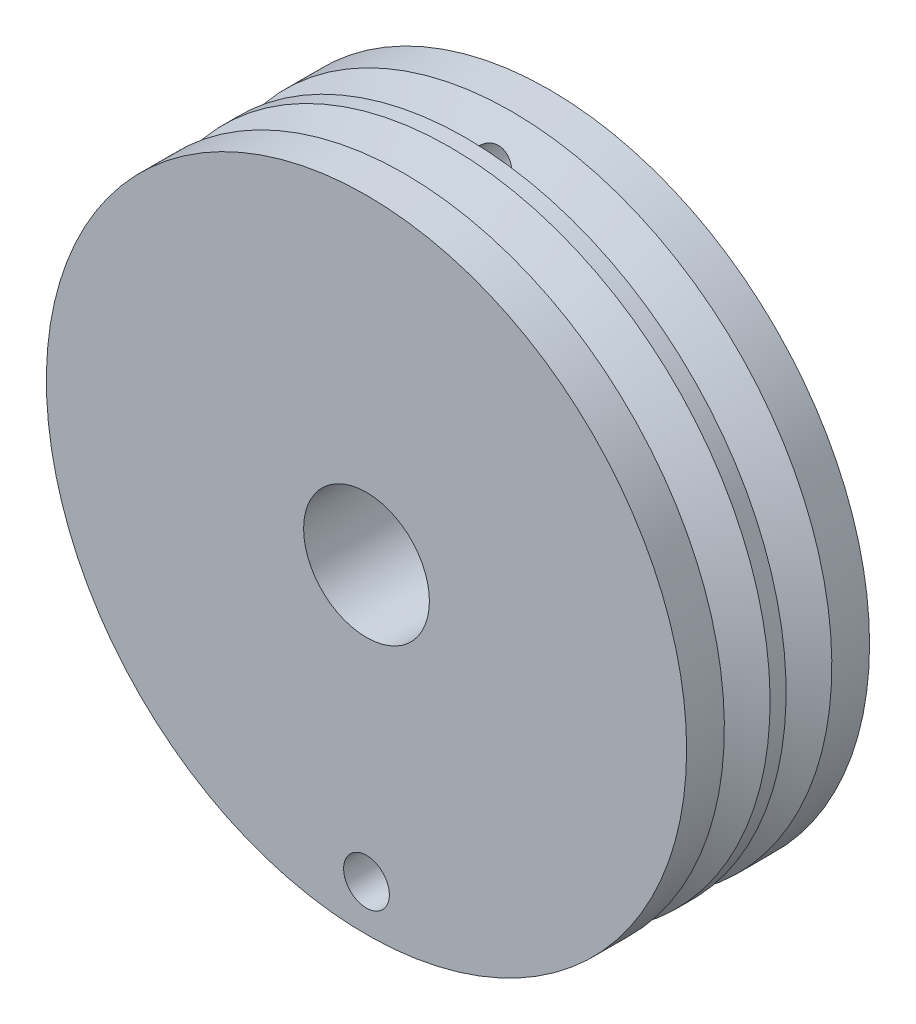
ISO-10303-21;
HEADER;
FILE_DESCRIPTION(('STEP AP214'),'2;1');
FILE_NAME('part.step','',(''),(''),'','','');
FILE_SCHEMA(('AUTOMOTIVE_DESIGN { 1 0 10303 214 1 1 1 1 }'));
ENDSEC;
DATA;
#1=APPLICATION_CONTEXT('core data for automotive mechanical design processes');
#2=APPLICATION_PROTOCOL_DEFINITION('international standard','automotive_design',2000,#1);
#3=PRODUCT_CONTEXT('',#1,'mechanical');
#4=PRODUCT('Part','Part','',(#3));
#5=PRODUCT_RELATED_PRODUCT_CATEGORY('part','',(#4));
#6=PRODUCT_DEFINITION_FORMATION('','',#4);
#7=PRODUCT_DEFINITION_CONTEXT('part definition',#1,'design');
#8=PRODUCT_DEFINITION('design','',#6,#7);
#9=PRODUCT_DEFINITION_SHAPE('','',#8);
#10=(LENGTH_UNIT() NAMED_UNIT(*) SI_UNIT(.MILLI.,.METRE.));
#11=(NAMED_UNIT(*) PLANE_ANGLE_UNIT() SI_UNIT($,.RADIAN.));
#12=(NAMED_UNIT(*) SI_UNIT($,.STERADIAN.) SOLID_ANGLE_UNIT());
#13=UNCERTAINTY_MEASURE_WITH_UNIT(LENGTH_MEASURE(1.E-05),#10,'distance_accuracy_value','');
#14=(GEOMETRIC_REPRESENTATION_CONTEXT(3) GLOBAL_UNCERTAINTY_ASSIGNED_CONTEXT((#13)) GLOBAL_UNIT_ASSIGNED_CONTEXT((#10,
#11,#12)) REPRESENTATION_CONTEXT('',''));
#15=CARTESIAN_POINT('',(0.,0.,0.));
#16=DIRECTION('',(0.,0.,1.));
#17=DIRECTION('',(1.,0.,0.));
#18=AXIS2_PLACEMENT_3D('',#15,#16,#17);
#19=CARTESIAN_POINT('',(0.,0.,4.));
#20=DIRECTION('',(0.,0.,-1.));
#21=DIRECTION('',(-1.,0.,0.));
#22=AXIS2_PLACEMENT_3D('',#19,#20,#21);
#23=CYLINDRICAL_SURFACE('',#22,14.);
#24=CARTESIAN_POINT('',(0.,0.,-0.349999999999999));
#25=DIRECTION('',(0.,0.,-1.));
#26=DIRECTION('',(0.,1.,0.));
#27=AXIS2_PLACEMENT_3D('',#24,#25,#26);
#28=CIRCLE('',#27,14.);
#29=CARTESIAN_POINT('',(0.,14.,-0.349999999999997));
#30=VERTEX_POINT('',#29);
#31=EDGE_CURVE('E91',#30,#30,#28,.T.);
#32=ORIENTED_EDGE('',*,*,#31,.F.);
#33=EDGE_LOOP('',(#32));
#34=FACE_BOUND('',#33,.T.);
#35=CARTESIAN_POINT('',(0.,0.,0.349999999999999));
#36=DIRECTION('',(0.,0.,-1.));
#37=DIRECTION('',(0.,1.,0.));
#38=AXIS2_PLACEMENT_3D('',#35,#36,#37);
#39=CIRCLE('',#38,14.);
#40=CARTESIAN_POINT('',(0.,14.,0.35));
#41=VERTEX_POINT('',#40);
#42=EDGE_CURVE('E95',#41,#41,#39,.T.);
#43=ORIENTED_EDGE('',*,*,#42,.T.);
#44=EDGE_LOOP('',(#43));
#45=FACE_BOUND('',#44,.T.);
#46=ADVANCED_FACE('F33',(#34,#45),#23,.T.);
#47=CARTESIAN_POINT('',(0.,0.,-4.));
#48=DIRECTION('',(0.,0.,1.));
#49=DIRECTION('',(1.,0.,0.));
#50=AXIS2_PLACEMENT_3D('',#47,#48,#49);
#51=CIRCLE('',#50,14.);
#52=CARTESIAN_POINT('',(14.,0.,-4.));
#53=VERTEX_POINT('',#52);
#54=EDGE_CURVE('E37',#53,#53,#51,.T.);
#55=ORIENTED_EDGE('',*,*,#54,.T.);
#56=EDGE_LOOP('',(#55));
#57=FACE_BOUND('',#56,.T.);
#58=CARTESIAN_POINT('',(0.,0.,-2.35));
#59=DIRECTION('',(0.,0.,-1.));
#60=DIRECTION('',(0.,1.,0.));
#61=AXIS2_PLACEMENT_3D('',#58,#59,#60);
#62=CIRCLE('',#61,14.);
#63=CARTESIAN_POINT('',(0.,14.,-2.35));
#64=VERTEX_POINT('',#63);
#65=EDGE_CURVE('E87',#64,#64,#62,.T.);
#66=ORIENTED_EDGE('',*,*,#65,.T.);
#67=EDGE_LOOP('',(#66));
#68=FACE_BOUND('',#67,.T.);
#69=ADVANCED_FACE('F35',(#57,#68),#23,.T.);
#70=CARTESIAN_POINT('',(0.,0.,-4.));
#71=DIRECTION('',(0.,0.,1.));
#72=DIRECTION('',(1.,0.,0.));
#73=AXIS2_PLACEMENT_3D('',#70,#71,#72);
#74=PLANE('',#73);
#75=CARTESIAN_POINT('',(0.,0.,-4.));
#76=DIRECTION('',(0.,0.,-1.));
#77=DIRECTION('',(-1.,0.,0.));
#78=AXIS2_PLACEMENT_3D('',#75,#76,#77);
#79=CIRCLE('',#78,2.75);
#80=CARTESIAN_POINT('',(-2.75,0.,-4.));
#81=VERTEX_POINT('',#80);
#82=EDGE_CURVE('E188',#81,#81,#79,.T.);
#83=ORIENTED_EDGE('',*,*,#82,.F.);
#84=EDGE_LOOP('',(#83));
#85=FACE_BOUND('',#84,.T.);
#86=CARTESIAN_POINT('',(0.,12.,-4.));
#87=DIRECTION('',(0.,0.,-1.));
#88=DIRECTION('',(-1.,0.,0.));
#89=AXIS2_PLACEMENT_3D('',#86,#87,#88);
#90=CIRCLE('',#89,1.);
#91=CARTESIAN_POINT('',(-1.,12.,-4.));
#92=VERTEX_POINT('',#91);
#93=EDGE_CURVE('E80',#92,#92,#90,.T.);
#94=ORIENTED_EDGE('',*,*,#93,.F.);
#95=EDGE_LOOP('',(#94));
#96=FACE_BOUND('',#95,.T.);
#97=ORIENTED_EDGE('',*,*,#54,.F.);
#98=EDGE_LOOP('',(#97));
#99=FACE_BOUND('',#98,.T.);
#100=ADVANCED_FACE('F157',(#85,#96,#99),#74,.F.);
#101=CARTESIAN_POINT('',(0.,0.,-2.35));
#102=DIRECTION('',(0.,0.,-1.));
#103=DIRECTION('',(0.,1.,0.));
#104=AXIS2_PLACEMENT_3D('',#101,#102,#103);
#105=CONICAL_SURFACE('',#104,14.,1.0471975511966);
#106=CARTESIAN_POINT('',(0.,0.,-1.35));
#107=DIRECTION('',(0.,0.,-1.));
#108=DIRECTION('',(0.,1.,0.));
#109=AXIS2_PLACEMENT_3D('',#106,#107,#108);
#110=CIRCLE('',#109,12.2679491924311);
#111=CARTESIAN_POINT('',(0.973361909262569,12.2292740578363,-1.35));
#112=VERTEX_POINT('',#111);
#113=CARTESIAN_POINT('',(0.973361909262572,-12.2292740578363,-1.35));
#114=VERTEX_POINT('',#113);
#115=EDGE_CURVE('E78',#112,#114,#110,.T.);
#116=ORIENTED_EDGE('',*,*,#115,.T.);
#117=CARTESIAN_POINT('',(-0.675238554979176,-12.7375994128725,-1.63147866548817));
#118=CARTESIAN_POINT('',(-0.720022320906997,-12.6965977209987,-1.60920824650398));
#119=CARTESIAN_POINT('',(-0.760552393840724,-12.6519732928259,-1.58486848276208));
#120=CARTESIAN_POINT('',(-0.832385405144509,-12.5573857249043,-1.53298187535221));
#121=CARTESIAN_POINT('',(-0.863665902276737,-12.5074099952053,-1.50542745433852));
#122=CARTESIAN_POINT('',(-0.916519438726047,-12.4041492538857,-1.44813674740481));
#123=CARTESIAN_POINT('',(-0.938142176831289,-12.3508828287452,-1.41841256957598));
#124=CARTESIAN_POINT('',(-0.971861359344019,-12.2423173823084,-1.35742785626635));
#125=CARTESIAN_POINT('',(-0.983961295626812,-12.1870191138524,-1.32616788840915));
#126=CARTESIAN_POINT('',(-0.999440488029554,-12.0701729027941,-1.25965846389196));
#127=CARTESIAN_POINT('',(-1.00184372027432,-12.0085457345204,-1.2243192643822));
#128=CARTESIAN_POINT('',(-0.995371635039222,-11.8859515271464,-1.15347422984462));
#129=CARTESIAN_POINT('',(-0.986489875896394,-11.8249848851264,-1.11796831118068));
#130=CARTESIAN_POINT('',(-0.95678428104487,-11.7020494931145,-1.04582013836301));
#131=CARTESIAN_POINT('',(-0.935343250250365,-11.6402035061072,-1.00921962155327));
#132=CARTESIAN_POINT('',(-0.880205999920555,-11.5208799785061,-0.938051126191382));
#133=CARTESIAN_POINT('',(-0.846506199040652,-11.4634037204475,-0.903483745042503));
#134=CARTESIAN_POINT('',(-0.768783725872347,-11.357254983384,-0.839186083072163));
#135=CARTESIAN_POINT('',(-0.725241797896944,-11.3083178993548,-0.809315457895968));
#136=CARTESIAN_POINT('',(-0.627787861001372,-11.2188240554582,-0.754366810781214));
#137=CARTESIAN_POINT('',(-0.573898029177586,-11.178249751701,-0.729278764175732));
#138=CARTESIAN_POINT('',(-0.473441473798533,-11.1178029102985,-0.691736839747212));
#139=CARTESIAN_POINT('',(-0.429023377783137,-11.0953126638338,-0.677710724031585));
#140=CARTESIAN_POINT('',(-0.336386108557305,-11.0569459238841,-0.653726392736968));
#141=CARTESIAN_POINT('',(-0.288169665580377,-11.0410647305106,-0.643765286510391));
#142=CARTESIAN_POINT('',(-0.188967803832708,-11.016684030453,-0.628453456595904));
#143=CARTESIAN_POINT('',(-0.137971773976055,-11.0082152735366,-0.623121939019995));
#144=CARTESIAN_POINT('',(-0.0350059968058469,-10.9992790948796,-0.617495797030779));
#145=CARTESIAN_POINT('',(0.0169635439363698,-10.9988099945039,-0.617200115905674));
#146=CARTESIAN_POINT('',(0.116406150268353,-11.0056384888688,-0.621499785029481));
#147=CARTESIAN_POINT('',(0.163934183448347,-11.0123809470214,-0.625745542600081));
#148=CARTESIAN_POINT('',(0.257011407196844,-11.032419623312,-0.638338610851396));
#149=CARTESIAN_POINT('',(0.302560559628211,-11.0457159676962,-0.64668600054094));
#150=CARTESIAN_POINT('',(0.391412694789465,-11.0785436658509,-0.667236016105404));
#151=CARTESIAN_POINT('',(0.434658430356921,-11.098185968232,-0.67950720057657));
#152=CARTESIAN_POINT('',(0.51714949040391,-11.142819522512,-0.70728893548473));
#153=CARTESIAN_POINT('',(0.556393471270372,-11.1678125622801,-0.722800568627257));
#154=CARTESIAN_POINT('',(0.634316830009591,-11.2252545083308,-0.758299228987592));
#155=CARTESIAN_POINT('',(0.672478789155364,-11.2582168328176,-0.778588508890146));
#156=CARTESIAN_POINT('',(0.742771265192854,-11.3286068557797,-0.821686471198158));
#157=CARTESIAN_POINT('',(0.774898641295723,-11.3660368630446,-0.844496455786965));
#158=CARTESIAN_POINT('',(0.837143698016393,-11.4501681785105,-0.895476017570757));
#159=CARTESIAN_POINT('',(0.866271425272342,-11.4974234993802,-0.923940520096219));
#160=CARTESIAN_POINT('',(0.916083753520678,-11.5952672807164,-0.982476358032948));
#161=CARTESIAN_POINT('',(0.936763706523888,-11.6458575583566,-1.01254856774754));
#162=CARTESIAN_POINT('',(0.971701852408131,-11.7559714542352,-1.07755082610241));
#163=CARTESIAN_POINT('',(0.984774447735356,-11.8158009736022,-1.11260385256079));
#164=CARTESIAN_POINT('',(0.999857581697869,-11.9367405244571,-1.18291112302996));
#165=CARTESIAN_POINT('',(1.00186307602429,-11.9978511271181,-1.21816545146579));
#166=CARTESIAN_POINT('',(0.99445185409701,-12.1235591647515,-1.29014245302813));
#167=CARTESIAN_POINT('',(0.984328914846913,-12.188141219886,-1.32682302581769));
#168=CARTESIAN_POINT('',(0.95133408244718,-12.3150573103123,-1.39837045218168));
#169=CARTESIAN_POINT('',(0.928461580182408,-12.3773912380474,-1.43323721901383));
#170=CARTESIAN_POINT('',(0.871002045939454,-12.4954981859107,-1.49885666582632));
#171=CARTESIAN_POINT('',(0.836845091738304,-12.5514231431787,-1.52970961452955));
#172=CARTESIAN_POINT('',(0.757005957087552,-12.6567319996592,-1.58748033214776));
#173=CARTESIAN_POINT('',(0.711332917960205,-12.706121039806,-1.61440119565953));
#174=CARTESIAN_POINT('',(0.615165626171766,-12.7906953801606,-1.66029339399786));
#175=CARTESIAN_POINT('',(0.565794544764387,-12.8268540791982,-1.67981867539764));
#176=CARTESIAN_POINT('',(0.459986371437826,-12.8900540542585,-1.71384428466045));
#177=CARTESIAN_POINT('',(0.403557411866244,-12.9171056934289,-1.72835032456805));
#178=CARTESIAN_POINT('',(0.293434941541178,-12.9575328759505,-1.74998991128718));
#179=CARTESIAN_POINT('',(0.240372945942375,-12.9722473201133,-1.75784658710392));
#180=CARTESIAN_POINT('',(0.132085565488276,-12.9927653174404,-1.76879515955694));
#181=CARTESIAN_POINT('',(0.0768616778684911,-12.9985749295497,-1.77189029600188));
#182=CARTESIAN_POINT('',(-0.0289831034313437,-13.0008575588093,-1.77310671828371));
#183=CARTESIAN_POINT('',(-0.0795847494468614,-12.9981017335398,-1.77163881857472));
#184=CARTESIAN_POINT('',(-0.179524468937598,-12.9850428433237,-1.76467504620733));
#185=CARTESIAN_POINT('',(-0.228862438921531,-12.9747391622628,-1.75917884472782));
#186=CARTESIAN_POINT('',(-0.324429251014717,-12.9472047734854,-1.74446371881643));
#187=CARTESIAN_POINT('',(-0.370683656414554,-12.9300423830054,-1.7352815055424));
#188=CARTESIAN_POINT('',(-0.459491188600473,-12.8895206772335,-1.71354612859023));
#189=CARTESIAN_POINT('',(-0.502047286263666,-12.866166398185,-1.70099570438386));
#190=CARTESIAN_POINT('',(-0.566137406260277,-12.8247988589271,-1.67869475015617));
#191=CARTESIAN_POINT('',(-0.58914848196976,-12.8085099935059,-1.6698996742332));
#192=CARTESIAN_POINT('',(-0.633480967388544,-12.7742651735791,-1.65137282496798));
#193=CARTESIAN_POINT('',(-0.654802638231634,-12.7563094776533,-1.64164119690698));
#194=CARTESIAN_POINT('',(-0.675238554979176,-12.7375994128725,-1.63147866548817));
#195=B_SPLINE_CURVE_WITH_KNOTS('',3,(#117,#118,#119,#120,#121,#122,#123,#124,#125,#126,#127,
#128,#129,#130,#131,#132,#133,#134,#135,#136,#137,#138,#139,#140,#141,#142,#143,#144,#145,#146,
#147,#148,#149,#150,#151,#152,#153,#154,#155,#156,#157,#158,#159,#160,#161,#162,#163,#164,#165,
#166,#167,#168,#169,#170,#171,#172,#173,#174,#175,#176,#177,#178,#179,#180,#181,#182,#183,#184,
#185,#186,#187,#188,#189,#190,#191,#192,#193,#194),.UNSPECIFIED.,.T.,.F.,(4,2,2,2,2,2,2,2,2,2,2,
2,2,2,2,2,2,2,2,2,2,2,2,2,2,2,2,2,2,2,2,2,2,2,2,2,2,2,4),(0.,0.193903094745397,
0.388272846491085,0.581630511651245,0.774917242242038,0.987236454022243,1.19967691564658,
1.42355477807743,1.64749809801689,1.86224507482275,2.07653685253623,2.23107009458106,
2.38549325500937,2.54055402929805,2.69558226548298,2.8394813629225,2.98338323236701,
3.1299510854969,3.27656798873683,3.43899842003115,3.60151315782882,3.78792164277697,
3.97443255250497,4.18521007183686,4.3960836541889,4.619856776231,4.84364059003405,
5.0597257093055,5.27563983998997,5.46722453395428,5.65859047621178,5.82454910342282,
5.99039476036665,6.1417551248398,6.29312784589219,6.44302894667719,6.5928084957485,
6.6813048786895,6.76978755582063),.UNSPECIFIED.);
#196=CARTESIAN_POINT('',(-0.973361909262566,-12.2292740578363,-1.35));
#197=VERTEX_POINT('',#196);
#198=EDGE_CURVE('E48',#197,#114,#195,.T.);
#199=ORIENTED_EDGE('',*,*,#198,.F.);
#200=CARTESIAN_POINT('',(-0.973361909262569,12.2292740578363,-1.35));
#201=VERTEX_POINT('',#200);
#202=EDGE_CURVE('E79',#197,#201,#110,.T.);
#203=ORIENTED_EDGE('',*,*,#202,.T.);
#204=CARTESIAN_POINT('',(0.973445258504089,12.2289199176479,-1.3498));
#205=CARTESIAN_POINT('',(0.959932946757562,12.2864930462102,-1.38232210965292));
#206=CARTESIAN_POINT('',(0.941150016686874,12.3433179428461,-1.41418299822541));
#207=CARTESIAN_POINT('',(0.893048934182525,12.4539989361448,-1.4758585550579));
#208=CARTESIAN_POINT('',(0.863669338020977,12.5078355600712,-1.50566005568926));
#209=CARTESIAN_POINT('',(0.794426035523728,12.6105202761801,-1.56218393626844));
#210=CARTESIAN_POINT('',(0.754527081232005,12.6593508154025,-1.58889552133194));
#211=CARTESIAN_POINT('',(0.664986896440287,12.7495424117851,-1.63800346429363));
#212=CARTESIAN_POINT('',(0.61536990985699,12.7909215748914,-1.66041029135263));
#213=CARTESIAN_POINT('',(0.513346663381869,12.860152733621,-1.69776699928951));
#214=CARTESIAN_POINT('',(0.461798896217514,12.8889755687666,-1.71325663287665));
#215=CARTESIAN_POINT('',(0.353343446491211,12.937371323507,-1.73920930918869));
#216=CARTESIAN_POINT('',(0.296438727806905,12.9569493223997,-1.74967511215905));
#217=CARTESIAN_POINT('',(0.186522347356941,12.9838757225356,-1.76405455854301));
#218=CARTESIAN_POINT('',(0.133887686321733,12.9924284377408,-1.76861377863553));
#219=CARTESIAN_POINT('',(0.0277451982763884,13.0010295666777,-1.77319879529633));
#220=CARTESIAN_POINT('',(-0.025762126814664,13.0010827076846,-1.77322711185293));
#221=CARTESIAN_POINT('',(-0.128535245458377,12.9929592310962,-1.76889673644757));
#222=CARTESIAN_POINT('',(-0.177855267891299,12.9853028960125,-1.76481538970156));
#223=CARTESIAN_POINT('',(-0.274370227343342,12.9628993782594,-1.75285362956679));
#224=CARTESIAN_POINT('',(-0.321565114734843,12.9481520300896,-1.74497312750778));
#225=CARTESIAN_POINT('',(-0.413326770468206,12.9119378787842,-1.72557671833404));
#226=CARTESIAN_POINT('',(-0.457844327015142,12.8903748922164,-1.71400875191139));
#227=CARTESIAN_POINT('',(-0.542528054223732,12.8414608677699,-1.68768872986495));
#228=CARTESIAN_POINT('',(-0.58269346827408,12.8141088259086,-1.67293612192721));
#229=CARTESIAN_POINT('',(-0.660948188039905,12.7522147462122,-1.63943322338695));
#230=CARTESIAN_POINT('',(-0.698628548487939,12.7172773767252,-1.6204603333728));
#231=CARTESIAN_POINT('',(-0.76762525384033,12.6429063580937,-1.57989294564603));
#232=CARTESIAN_POINT('',(-0.798936160129658,12.6034689109887,-1.55829623247812));
#233=CARTESIAN_POINT('',(-0.858134945354917,12.5164190209242,-1.51039130476602));
#234=CARTESIAN_POINT('',(-0.885200054715429,12.4683893541389,-1.48382728738788));
#235=CARTESIAN_POINT('',(-0.930803486904879,12.3695433075945,-1.42883018120639));
#236=CARTESIAN_POINT('',(-0.949353628068164,12.3187309005203,-1.4003997459653));
#237=CARTESIAN_POINT('',(-0.967175292713177,12.2544531358491,-1.36420907679809));
#238=CARTESIAN_POINT('',(-0.970439282764846,12.2417047404797,-1.35702043402791));
#239=CARTESIAN_POINT('',(-0.973445258504089,12.2289199176479,-1.3498));
#240=B_SPLINE_CURVE_WITH_KNOTS('',3,(#204,#205,#206,#207,#208,#209,#210,#211,#212,#213,#214,
#215,#216,#217,#218,#219,#220,#221,#222,#223,#224,#225,#226,#227,#228,#229,#230,#231,#232,#233,
#234,#235,#236,#237,#238,#239),.UNSPECIFIED.,.F.,.F.,(4,2,2,2,2,2,2,2,2,2,2,2,2,2,2,2,2,4),(0.,
0.202416957617237,0.406026992810455,0.610328146123122,0.814125969027374,0.99623967109875,
1.17825319950622,1.33797054583539,1.49759906060053,1.64713179251198,1.79666801460594,
1.94841655782129,2.10019144003464,2.2638527671487,2.42765325674524,2.61052163671196,
2.79313543164116,2.83810971996163),.UNSPECIFIED.);
#241=EDGE_CURVE('E86',#112,#201,#240,.T.);
#242=ORIENTED_EDGE('',*,*,#241,.F.);
#243=EDGE_LOOP('',(#116,#199,#203,#242));
#244=FACE_BOUND('',#243,.T.);
#245=ORIENTED_EDGE('',*,*,#65,.F.);
#246=EDGE_LOOP('',(#245));
#247=FACE_BOUND('',#246,.T.);
#248=ADVANCED_FACE('F83',(#244,#247),#105,.T.);
#249=CARTESIAN_POINT('',(0.,0.,-1.35));
#250=DIRECTION('',(0.,0.,1.));
#251=DIRECTION('',(0.,-1.,0.));
#252=AXIS2_PLACEMENT_3D('',#249,#250,#251);
#253=CONICAL_SURFACE('',#252,12.2679491924311,1.0471975511966);
#254=CARTESIAN_POINT('',(0.867677964925932,-11.5028733067094,-1.77284973081026));
#255=CARTESIAN_POINT('',(0.90545318517326,-11.568814979395,-1.73322229307735));
#256=CARTESIAN_POINT('',(0.935228930658014,-11.6381816557594,-1.6919362697575));
#257=CARTESIAN_POINT('',(0.978515955292399,-11.7808015313977,-1.60784514974752));
#258=CARTESIAN_POINT('',(0.992055329800564,-11.8540477873916,-1.56504280944738));
#259=CARTESIAN_POINT('',(1.0019666805283,-11.991068440638,-1.48572861234764));
#260=CARTESIAN_POINT('',(1.00053204332079,-12.0546861676359,-1.44919940167401));
#261=CARTESIAN_POINT('',(0.985520970323151,-12.1810964193345,-1.37716887600997));
#262=CARTESIAN_POINT('',(0.97194569261206,-12.2438890221632,-1.34166746331276));
#263=CARTESIAN_POINT('',(0.932367711047626,-12.3673317723926,-1.27237294855985));
#264=CARTESIAN_POINT('',(0.906245952419198,-12.4279552889111,-1.23859971529424));
#265=CARTESIAN_POINT('',(0.841611684720657,-12.5441525679966,-1.1742821997054));
#266=CARTESIAN_POINT('',(0.803103884735191,-12.5997282394368,-1.1437366960765));
#267=CARTESIAN_POINT('',(0.718218914840483,-12.698583704665,-1.08969815709189));
#268=CARTESIAN_POINT('',(0.672855273839704,-12.7425189256967,-1.06581852110495));
#269=CARTESIAN_POINT('',(0.573239706690194,-12.8218491025576,-1.02287083368354));
#270=CARTESIAN_POINT('',(0.518998123023488,-12.8572538787927,-1.00379724826461));
#271=CARTESIAN_POINT('',(0.411067582569412,-12.9133540516686,-0.973656972266201));
#272=CARTESIAN_POINT('',(0.358275080603179,-12.9353834836825,-0.961860560241497));
#273=CARTESIAN_POINT('',(0.248910011577284,-12.9702204306424,-0.943231888580135));
#274=CARTESIAN_POINT('',(0.192340739708996,-12.9830358726951,-0.936395361740748));
#275=CARTESIAN_POINT('',(0.0837694338096895,-12.9978231278881,-0.928509613440002));
#276=CARTESIAN_POINT('',(0.0319456945694349,-13.0008287891614,-0.926908583714318));
#277=CARTESIAN_POINT('',(-0.0714893470845325,-12.9987802478988,-0.928000315400301));
#278=CARTESIAN_POINT('',(-0.123100707062589,-12.9937283964413,-0.93069182430453));
#279=CARTESIAN_POINT('',(-0.222583379194605,-12.9761716652159,-0.940058713738476));
#280=CARTESIAN_POINT('',(-0.270522192143712,-12.9639608805251,-0.946576904556918));
#281=CARTESIAN_POINT('',(-0.363519547117861,-12.9328762429628,-0.963204178214797));
#282=CARTESIAN_POINT('',(-0.408577826044334,-12.9140017824768,-0.973313588513146));
#283=CARTESIAN_POINT('',(-0.496422962183836,-12.8695275476457,-0.99719929708766));
#284=CARTESIAN_POINT('',(-0.53906181795329,-12.8437026242791,-1.01109860900232));
#285=CARTESIAN_POINT('',(-0.619343879508276,-12.7866642797529,-1.04190352901194));
#286=CARTESIAN_POINT('',(-0.656985425441126,-12.7554490760968,-1.05881013163514));
#287=CARTESIAN_POINT('',(-0.729989027175184,-12.685495803884,-1.09684940721339));
#288=CARTESIAN_POINT('',(-0.764808731007841,-12.6463272118406,-1.11822943288109));
#289=CARTESIAN_POINT('',(-0.827410118129158,-12.5639781790452,-1.163401076305));
#290=CARTESIAN_POINT('',(-0.855188851848622,-12.5207960672874,-1.18719369891059));
#291=CARTESIAN_POINT('',(-0.906432196250471,-12.4261614189036,-1.23961589351085));
#292=CARTESIAN_POINT('',(-0.928972156268571,-12.3743395921569,-1.26848272498554));
#293=CARTESIAN_POINT('',(-0.96490578825884,-12.2684872397121,-1.32782718119072));
#294=CARTESIAN_POINT('',(-0.978293698911643,-12.2144553453885,-1.35830580758399));
#295=CARTESIAN_POINT('',(-0.996946095501189,-12.0993373364245,-1.42368023852894));
#296=CARTESIAN_POINT('',(-1.00113227145387,-12.0381391742806,-1.45868832423403));
#297=CARTESIAN_POINT('',(-0.998346026460387,-11.9161822032454,-1.52898982279788));
#298=CARTESIAN_POINT('',(-0.991375562399639,-11.855423319182,-1.56428318453865));
#299=CARTESIAN_POINT('',(-0.968278764787837,-11.7447799137179,-1.62904785386813));
#300=CARTESIAN_POINT('',(-0.953671691074406,-11.6946242031463,-1.65860298086559));
#301=CARTESIAN_POINT('',(-0.916568598074566,-11.5967141961564,-1.71666165749462));
#302=CARTESIAN_POINT('',(-0.894075564824582,-11.5489589985932,-1.74516560065064));
#303=CARTESIAN_POINT('',(-0.867677964925927,-11.5028733067094,-1.77284973081026));
#304=B_SPLINE_CURVE_WITH_KNOTS('',3,(#254,#255,#256,#257,#258,#259,#260,#261,#262,#263,#264,
#265,#266,#267,#268,#269,#270,#271,#272,#273,#274,#275,#276,#277,#278,#279,#280,#281,#282,#283,
#284,#285,#286,#287,#288,#289,#290,#291,#292,#293,#294,#295,#296,#297,#298,#299,#300,#301,#302,
#303),.UNSPECIFIED.,.F.,.F.,(4,2,2,2,2,2,2,2,2,2,2,2,2,2,2,2,2,2,2,2,2,2,2,2,4),(0.,
0.25652206011712,0.51259959189169,0.731762702135015,0.95090490893957,1.17216894060986,
1.39334894850953,1.59472191244283,1.79586193241351,1.97009893305242,2.14418585175708,
2.29920741263117,2.45418374848725,2.60320010844854,2.75223005968878,2.90683437966731,
3.06148992355954,3.23060821424136,3.39979723448409,3.58939572692461,3.77911346413761,
3.99008894274053,4.20102742009621,4.38053073115246,4.55996614615184),.UNSPECIFIED.);
#305=EDGE_CURVE('E68',#114,#197,#304,.T.);
#306=ORIENTED_EDGE('',*,*,#305,.F.);
#307=ORIENTED_EDGE('',*,*,#115,.F.);
#308=CARTESIAN_POINT('',(-0.483283355760899,11.1245335559788,-2.00409088382833));
#309=CARTESIAN_POINT('',(-0.441446829346308,11.1014384927822,-2.01846057778676));
#310=CARTESIAN_POINT('',(-0.397504326778326,11.0811044781411,-2.03116242497791));
#311=CARTESIAN_POINT('',(-0.306274818103919,11.0468124796837,-2.05262631007141));
#312=CARTESIAN_POINT('',(-0.258988480836298,11.0328532249212,-2.06138913329801));
#313=CARTESIAN_POINT('',(-0.162112404855313,11.0119807807966,-2.07450570020136));
#314=CARTESIAN_POINT('',(-0.11251562022192,11.0050908508772,-2.07884488896919));
#315=CARTESIAN_POINT('',(-0.0126639812718066,10.9988304763539,-2.08278717060717));
#316=CARTESIAN_POINT('',(0.0375907527860658,10.9994586762489,-2.08239111723044));
#317=CARTESIAN_POINT('',(0.135013811030562,11.008002197221,-2.07701223250452));
#318=CARTESIAN_POINT('',(0.182221623065084,11.0156012057523,-2.07222850092681));
#319=CARTESIAN_POINT('',(0.27451874964204,11.0372500500013,-2.05862896089999));
#320=CARTESIAN_POINT('',(0.319607827929475,11.0513006032428,-2.04981270396447));
#321=CARTESIAN_POINT('',(0.407757225918361,11.0856530753768,-2.02832138494758));
#322=CARTESIAN_POINT('',(0.450734481952341,11.106107824133,-2.0155520815079));
#323=CARTESIAN_POINT('',(0.532565877580165,11.1523065751318,-1.98682031113135));
#324=CARTESIAN_POINT('',(0.571418592403491,11.1780523961501,-1.97085674623536));
#325=CARTESIAN_POINT('',(0.648563198541036,11.2371224268679,-1.93439007798179));
#326=CARTESIAN_POINT('',(0.686305722435799,11.2709723012483,-1.9135788780317));
#327=CARTESIAN_POINT('',(0.755619029040162,11.3430792817487,-1.86948587873154));
#328=CARTESIAN_POINT('',(0.787186569361478,11.3813386865792,-1.84620279127722));
#329=CARTESIAN_POINT('',(0.848111574942721,11.467204842445,-1.79424871887402));
#330=CARTESIAN_POINT('',(0.876454524860341,11.5153576526283,-1.76528979547831));
#331=CARTESIAN_POINT('',(0.924531505263037,11.6149013956035,-1.70583677858771));
#332=CARTESIAN_POINT('',(0.944260799842924,11.6662940920041,-1.67534185082722));
#333=CARTESIAN_POINT('',(0.976953472569097,11.77784304359,-1.60961363751882));
#334=CARTESIAN_POINT('',(0.988737721220059,11.8382827580874,-1.57427085360177));
#335=CARTESIAN_POINT('',(1.00109066824898,11.9602650572563,-1.5034948219894));
#336=CARTESIAN_POINT('',(1.0016544111128,12.021808117209,-1.46806154123522));
#337=CARTESIAN_POINT('',(0.99114051053299,12.1478382189838,-1.39604330182552));
#338=CARTESIAN_POINT('',(0.979414995212328,12.2122990710121,-1.35950357755174));
#339=CARTESIAN_POINT('',(0.943186336291872,12.3387037602978,-1.28837940537002));
#340=CARTESIAN_POINT('',(0.918683121412339,12.400647583512,-1.25379496837074));
#341=CARTESIAN_POINT('',(0.858207867052488,12.5173206852826,-1.18908542806948));
#342=CARTESIAN_POINT('',(0.822738988074183,12.5722403007502,-1.15883663646616));
#343=CARTESIAN_POINT('',(0.740480163616983,12.675295630815,-1.10238572230133));
#344=CARTESIAN_POINT('',(0.693699802294488,12.7234370342024,-1.07618020452557));
#345=CARTESIAN_POINT('',(0.595881748951292,12.8053011199135,-1.03181073786007));
#346=CARTESIAN_POINT('',(0.545967288475828,12.8400485626449,-1.01306660080901));
#347=CARTESIAN_POINT('',(0.43940517835493,12.9003655052145,-0.980620764430376));
#348=CARTESIAN_POINT('',(0.382765191832457,12.9259453196415,-0.966913397741084));
#349=CARTESIAN_POINT('',(0.272522582780064,12.9636747202255,-0.946728547531967));
#350=CARTESIAN_POINT('',(0.219501876566031,12.9771491195049,-0.939536786574802));
#351=CARTESIAN_POINT('',(0.111560021756883,12.9952600739528,-0.929875169553327));
#352=CARTESIAN_POINT('',(0.0566400447858551,12.9999019820836,-0.927402453492511));
#353=CARTESIAN_POINT('',(-0.0486474886162418,13.0000870571589,-0.927303921889504));
#354=CARTESIAN_POINT('',(-0.0990153713622083,12.9963519435072,-0.929293646135916));
#355=CARTESIAN_POINT('',(-0.19830165893148,12.9814252390186,-0.937254967690413));
#356=CARTESIAN_POINT('',(-0.247220221663007,12.9702344636443,-0.943226129528978));
#357=CARTESIAN_POINT('',(-0.342037743088573,12.9409889932748,-0.958861661256987));
#358=CARTESIAN_POINT('',(-0.387950976501792,12.9229700030991,-0.968506821107072));
#359=CARTESIAN_POINT('',(-0.47597667154013,12.880811862775,-0.991132758378585));
#360=CARTESIAN_POINT('',(-0.518088345594422,12.8566714483759,-1.00411422485106));
#361=CARTESIAN_POINT('',(-0.600265593523844,12.8014280369636,-1.03391782629019));
#362=CARTESIAN_POINT('',(-0.640027098476845,12.7699779865204,-1.05093277611222));
#363=CARTESIAN_POINT('',(-0.713701670521883,12.7022374944037,-1.08773040026172));
#364=CARTESIAN_POINT('',(-0.747612458426096,12.66594517611,-1.10751414778262));
#365=CARTESIAN_POINT('',(-0.812553796581822,12.5854179073311,-1.15161178107783));
#366=CARTESIAN_POINT('',(-0.842869082932032,12.5407484045701,-1.17618436739862));
#367=CARTESIAN_POINT('',(-0.895581397217235,12.4480842058497,-1.22744300574568));
#368=CARTESIAN_POINT('',(-0.917974633144602,12.4000879305909,-1.25413006243449));
#369=CARTESIAN_POINT('',(-0.957005224239745,12.295965920957,-1.31236959967007));
#370=CARTESIAN_POINT('',(-0.972609044553098,12.2395621372217,-1.34411874207405));
#371=CARTESIAN_POINT('',(-0.993784141032214,12.1255376336066,-1.40875395985297));
#372=CARTESIAN_POINT('',(-0.999351054284991,12.0679163955203,-1.44164052332264));
#373=CARTESIAN_POINT('',(-1.00059849887236,11.9473034669329,-1.51097684591723));
#374=CARTESIAN_POINT('',(-0.995286545434781,11.8843231671798,-1.54746755978271));
#375=CARTESIAN_POINT('',(-0.972861842400191,11.7601604108611,-1.61997983547777));
#376=CARTESIAN_POINT('',(-0.955741130857905,11.6989791963478,-1.65600106405516));
#377=CARTESIAN_POINT('',(-0.909252816472817,11.5786633839583,-1.72738772275651));
#378=CARTESIAN_POINT('',(-0.879585973324805,11.5196198864257,-1.76271342749069));
#379=CARTESIAN_POINT('',(-0.808222576820385,11.4073925404438,-1.83035768632091));
#380=CARTESIAN_POINT('',(-0.766544254686288,11.354199979151,-1.8626807003611));
#381=CARTESIAN_POINT('',(-0.685369321503307,11.2701808635831,-1.91406652412364));
#382=CARTESIAN_POINT('',(-0.648683301805161,11.2373180895605,-1.93427168677355));
#383=CARTESIAN_POINT('',(-0.569883463048248,11.1767767914703,-1.97164189203284));
#384=CARTESIAN_POINT('',(-0.527774252474847,11.1490939140998,-1.98880948681701));
#385=CARTESIAN_POINT('',(-0.483283355760899,11.1245335559788,-2.00409088382833));
#386=B_SPLINE_CURVE_WITH_KNOTS('',3,(#308,#309,#310,#311,#312,#313,#314,#315,#316,#317,#318,
#319,#320,#321,#322,#323,#324,#325,#326,#327,#328,#329,#330,#331,#332,#333,#334,#335,#336,#337,
#338,#339,#340,#341,#342,#343,#344,#345,#346,#347,#348,#349,#350,#351,#352,#353,#354,#355,#356,
#357,#358,#359,#360,#361,#362,#363,#364,#365,#366,#367,#368,#369,#370,#371,#372,#373,#374,#375,
#376,#377,#378,#379,#380,#381,#382,#383,#384,#385),.UNSPECIFIED.,.T.,.F.,(4,2,2,2,2,2,2,2,2,2,2,
2,2,2,2,2,2,2,2,2,2,2,2,2,2,2,2,2,2,2,2,2,2,2,2,2,2,2,4),(0.,0.149546826604797,
0.299063824781576,0.449071200352148,0.59905153035029,0.742545834829201,0.886056102232921,
1.03329224398751,1.18057908222662,1.34434911132784,1.50820490405374,1.69625413084141,
1.88440661985216,2.09648073850513,2.30864851719509,2.53259230494521,2.75653734196755,
2.97143788330788,3.18615697475113,3.37597000665071,3.56556880259415,3.73020505312482,
3.89474149345549,4.04565100181652,4.19654400716525,4.34665864170455,4.49680430453251,
4.65657198551588,4.81640176527701,4.99362845716445,5.17093986683475,5.36985191103847,
5.5688503988941,5.78680895940801,6.00491462029285,6.22854511509724,6.45183795153766,
6.61100733837045,6.77004234884044),.UNSPECIFIED.);
#387=EDGE_CURVE('E110',#201,#112,#386,.T.);
#388=ORIENTED_EDGE('',*,*,#387,.F.);
#389=ORIENTED_EDGE('',*,*,#202,.F.);
#390=EDGE_LOOP('',(#306,#307,#388,#389));
#391=FACE_BOUND('',#390,.T.);
#392=ORIENTED_EDGE('',*,*,#31,.T.);
#393=EDGE_LOOP('',(#392));
#394=FACE_BOUND('',#393,.T.);
#395=ADVANCED_FACE('F75',(#391,#394),#253,.T.);
#396=CARTESIAN_POINT('',(0.,0.,0.349999999999999));
#397=DIRECTION('',(0.,0.,-1.));
#398=DIRECTION('',(0.,1.,0.));
#399=AXIS2_PLACEMENT_3D('',#396,#397,#398);
#400=CONICAL_SURFACE('',#399,14.,1.0471975511966);
#401=CARTESIAN_POINT('',(-0.973445258504087,-12.2289199176479,1.3502));
#402=CARTESIAN_POINT('',(-0.95993294675756,-12.2864930462102,1.31767789034708));
#403=CARTESIAN_POINT('',(-0.941150016686872,-12.3433179428461,1.28581700177459));
#404=CARTESIAN_POINT('',(-0.893048934182523,-12.4539989361448,1.2241414449421));
#405=CARTESIAN_POINT('',(-0.863669338020975,-12.5078355600712,1.19433994431074));
#406=CARTESIAN_POINT('',(-0.794426035523725,-12.6105202761801,1.13781606373156));
#407=CARTESIAN_POINT('',(-0.754527081232001,-12.6593508154025,1.11110447866806));
#408=CARTESIAN_POINT('',(-0.664986896440283,-12.7495424117851,1.06199653570637));
#409=CARTESIAN_POINT('',(-0.615369909856986,-12.7909215748914,1.03958970864736));
#410=CARTESIAN_POINT('',(-0.513346663381864,-12.860152733621,1.00223300071049));
#411=CARTESIAN_POINT('',(-0.461798896217509,-12.8889755687666,0.98674336712335));
#412=CARTESIAN_POINT('',(-0.353343446491206,-12.937371323507,0.960790690811311));
#413=CARTESIAN_POINT('',(-0.296438727806899,-12.9569493223997,0.950324887840951));
#414=CARTESIAN_POINT('',(-0.186522347356936,-12.9838757225356,0.935945441456992));
#415=CARTESIAN_POINT('',(-0.133887686321728,-12.9924284377408,0.931386221364473));
#416=CARTESIAN_POINT('',(-0.027745198276383,-13.0010295666777,0.926801204703672));
#417=CARTESIAN_POINT('',(0.0257621268146695,-13.0010827076846,0.926772888147066));
#418=CARTESIAN_POINT('',(0.128535245458383,-12.9929592310962,0.931103263552428));
#419=CARTESIAN_POINT('',(0.177855267891304,-12.9853028960125,0.935184610298439));
#420=CARTESIAN_POINT('',(0.274370227343347,-12.9628993782594,0.947146370433213));
#421=CARTESIAN_POINT('',(0.321565114734848,-12.9481520300896,0.955026872492217));
#422=CARTESIAN_POINT('',(0.413326770468211,-12.9119378787842,0.974423281665963));
#423=CARTESIAN_POINT('',(0.457844327015147,-12.8903748922164,0.985991248088604));
#424=CARTESIAN_POINT('',(0.542528054223737,-12.8414608677699,1.01231127013505));
#425=CARTESIAN_POINT('',(0.582693468274085,-12.8141088259086,1.02706387807278));
#426=CARTESIAN_POINT('',(0.66094818803991,-12.7522147462122,1.06056677661305));
#427=CARTESIAN_POINT('',(0.698628548487944,-12.7172773767252,1.0795396666272));
#428=CARTESIAN_POINT('',(0.767625253840335,-12.6429063580937,1.12010705435397));
#429=CARTESIAN_POINT('',(0.798936160129662,-12.6034689109887,1.14170376752188));
#430=CARTESIAN_POINT('',(0.858134945354921,-12.5164190209242,1.18960869523398));
#431=CARTESIAN_POINT('',(0.885200054715434,-12.4683893541389,1.21617271261212));
#432=CARTESIAN_POINT('',(0.930803486904884,-12.3695433075945,1.27116981879361));
#433=CARTESIAN_POINT('',(0.949353628068169,-12.3187309005203,1.29960025403471));
#434=CARTESIAN_POINT('',(0.967175292713181,-12.2544531358491,1.33579092320191));
#435=CARTESIAN_POINT('',(0.97043928276485,-12.2417047404797,1.34297956597209));
#436=CARTESIAN_POINT('',(0.973445258504093,-12.2289199176479,1.3502));
#437=B_SPLINE_CURVE_WITH_KNOTS('',3,(#401,#402,#403,#404,#405,#406,#407,#408,#409,#410,#411,
#412,#413,#414,#415,#416,#417,#418,#419,#420,#421,#422,#423,#424,#425,#426,#427,#428,#429,#430,
#431,#432,#433,#434,#435,#436),.UNSPECIFIED.,.F.,.F.,(4,2,2,2,2,2,2,2,2,2,2,2,2,2,2,2,2,4),(0.,
0.202416957617237,0.406026992810459,0.610328146123126,0.814125969027379,0.996239671098756,
1.17825319950623,1.3379705458354,1.49759906060054,1.64713179251199,1.79666801460595,
1.9484165578213,2.10019144003465,2.26385276714871,2.42765325674525,2.61052163671197,
2.79313543164117,2.83810971996163),.UNSPECIFIED.);
#438=CARTESIAN_POINT('',(-0.973361909262566,-12.2292740578363,1.35));
#439=VERTEX_POINT('',#438);
#440=CARTESIAN_POINT('',(0.973361909262572,-12.2292740578363,1.35));
#441=VERTEX_POINT('',#440);
#442=EDGE_CURVE('E55',#439,#441,#437,.T.);
#443=ORIENTED_EDGE('',*,*,#442,.F.);
#444=CARTESIAN_POINT('',(0.,0.,1.35));
#445=DIRECTION('',(0.,0.,-1.));
#446=DIRECTION('',(0.,1.,0.));
#447=AXIS2_PLACEMENT_3D('',#444,#445,#446);
#448=CIRCLE('',#447,12.2679491924311);
#449=EDGE_CURVE('E101',#439,#441,#448,.T.);
#450=ORIENTED_EDGE('',*,*,#449,.T.);
#451=EDGE_LOOP('',(#443,#450));
#452=FACE_BOUND('',#451,.T.);
#453=ORIENTED_EDGE('',*,*,#42,.F.);
#454=EDGE_LOOP('',(#453));
#455=FACE_BOUND('',#454,.T.);
#456=ADVANCED_FACE('F132',(#452,#455),#400,.T.);
#457=CARTESIAN_POINT('',(0.,0.,1.35));
#458=DIRECTION('',(0.,0.,1.));
#459=DIRECTION('',(0.,-1.,0.));
#460=AXIS2_PLACEMENT_3D('',#457,#458,#459);
#461=CONICAL_SURFACE('',#460,12.2679491924311,1.0471975511966);
#462=CARTESIAN_POINT('',(0.97344525850409,-12.2289199176479,1.3498));
#463=CARTESIAN_POINT('',(0.959932946757563,-12.2864930462102,1.38232210965292));
#464=CARTESIAN_POINT('',(0.941150016686875,-12.3433179428461,1.41418299822541));
#465=CARTESIAN_POINT('',(0.893048934182525,-12.4539989361448,1.4758585550579));
#466=CARTESIAN_POINT('',(0.863669338020977,-12.5078355600712,1.50566005568927));
#467=CARTESIAN_POINT('',(0.794426035523727,-12.6105202761801,1.56218393626844));
#468=CARTESIAN_POINT('',(0.754527081232002,-12.6593508154025,1.58889552133194));
#469=CARTESIAN_POINT('',(0.664986896440284,-12.7495424117851,1.63800346429363));
#470=CARTESIAN_POINT('',(0.615369909856988,-12.7909215748914,1.66041029135264));
#471=CARTESIAN_POINT('',(0.513346663381866,-12.860152733621,1.69776699928951));
#472=CARTESIAN_POINT('',(0.461798896217511,-12.8889755687666,1.71325663287665));
#473=CARTESIAN_POINT('',(0.353343446491207,-12.937371323507,1.73920930918869));
#474=CARTESIAN_POINT('',(0.296438727806901,-12.9569493223997,1.74967511215905));
#475=CARTESIAN_POINT('',(0.186522347356938,-12.9838757225356,1.76405455854301));
#476=CARTESIAN_POINT('',(0.13388768632173,-12.9924284377408,1.76861377863552));
#477=CARTESIAN_POINT('',(0.0277451982763858,-13.0010295666777,1.77319879529632));
#478=CARTESIAN_POINT('',(-0.0257621268146661,-13.0010827076846,1.77322711185293));
#479=CARTESIAN_POINT('',(-0.128535245458379,-12.9929592310962,1.76889673644757));
#480=CARTESIAN_POINT('',(-0.177855267891301,-12.9853028960125,1.76481538970156));
#481=CARTESIAN_POINT('',(-0.274370227343344,-12.9628993782594,1.75285362956678));
#482=CARTESIAN_POINT('',(-0.321565114734844,-12.9481520300896,1.74497312750778));
#483=CARTESIAN_POINT('',(-0.413326770468207,-12.9119378787842,1.72557671833403));
#484=CARTESIAN_POINT('',(-0.457844327015144,-12.8903748922164,1.71400875191139));
#485=CARTESIAN_POINT('',(-0.542528054223734,-12.8414608677699,1.68768872986495));
#486=CARTESIAN_POINT('',(-0.582693468274081,-12.8141088259086,1.67293612192721));
#487=CARTESIAN_POINT('',(-0.660948188039906,-12.7522147462122,1.63943322338695));
#488=CARTESIAN_POINT('',(-0.69862854848794,-12.7172773767252,1.62046033337279));
#489=CARTESIAN_POINT('',(-0.767625253840332,-12.6429063580937,1.57989294564603));
#490=CARTESIAN_POINT('',(-0.798936160129658,-12.6034689109887,1.55829623247811));
#491=CARTESIAN_POINT('',(-0.858134945354917,-12.5164190209242,1.51039130476602));
#492=CARTESIAN_POINT('',(-0.88520005471543,-12.4683893541389,1.48382728738787));
#493=CARTESIAN_POINT('',(-0.930803486904879,-12.3695433075945,1.42883018120638));
#494=CARTESIAN_POINT('',(-0.949353628068164,-12.3187309005203,1.40039974596529));
#495=CARTESIAN_POINT('',(-0.967175292713174,-12.2544531358491,1.36420907679809));
#496=CARTESIAN_POINT('',(-0.970439282764843,-12.2417047404797,1.35702043402791));
#497=CARTESIAN_POINT('',(-0.973445258504084,-12.2289199176479,1.3498));
#498=B_SPLINE_CURVE_WITH_KNOTS('',3,(#462,#463,#464,#465,#466,#467,#468,#469,#470,#471,#472,
#473,#474,#475,#476,#477,#478,#479,#480,#481,#482,#483,#484,#485,#486,#487,#488,#489,#490,#491,
#492,#493,#494,#495,#496,#497),.UNSPECIFIED.,.F.,.F.,(4,2,2,2,2,2,2,2,2,2,2,2,2,2,2,2,2,4),(0.,
0.202416957617237,0.406026992810453,0.610328146123121,0.814125969027372,0.996239671098748,
1.17825319950622,1.33797054583539,1.49759906060053,1.64713179251198,1.79666801460594,
1.94841655782129,2.10019144003464,2.2638527671487,2.42765325674524,2.61052163671196,
2.79313543164116,2.83810971996161),.UNSPECIFIED.);
#499=EDGE_CURVE('E70',#441,#439,#498,.T.);
#500=ORIENTED_EDGE('',*,*,#499,.F.);
#501=ORIENTED_EDGE('',*,*,#449,.F.);
#502=EDGE_LOOP('',(#500,#501));
#503=FACE_BOUND('',#502,.T.);
#504=CARTESIAN_POINT('',(0.,0.,2.35));
#505=DIRECTION('',(0.,0.,-1.));
#506=DIRECTION('',(0.,1.,0.));
#507=AXIS2_PLACEMENT_3D('',#504,#505,#506);
#508=CIRCLE('',#507,14.);
#509=CARTESIAN_POINT('',(0.,14.,2.35));
#510=VERTEX_POINT('',#509);
#511=EDGE_CURVE('E98',#510,#510,#508,.T.);
#512=ORIENTED_EDGE('',*,*,#511,.T.);
#513=EDGE_LOOP('',(#512));
#514=FACE_BOUND('',#513,.T.);
#515=ADVANCED_FACE('F126',(#503,#514),#461,.T.);
#516=CARTESIAN_POINT('',(0.,0.,4.));
#517=DIRECTION('',(0.,0.,1.));
#518=DIRECTION('',(1.,0.,0.));
#519=AXIS2_PLACEMENT_3D('',#516,#517,#518);
#520=PLANE('',#519);
#521=CARTESIAN_POINT('',(0.,0.,4.));
#522=DIRECTION('',(0.,0.,1.));
#523=DIRECTION('',(1.,0.,0.));
#524=AXIS2_PLACEMENT_3D('',#521,#522,#523);
#525=CIRCLE('',#524,2.75);
#526=CARTESIAN_POINT('',(2.75,0.,4.));
#527=VERTEX_POINT('',#526);
#528=EDGE_CURVE('E198',#527,#527,#525,.F.);
#529=ORIENTED_EDGE('',*,*,#528,.T.);
#530=EDGE_LOOP('',(#529));
#531=FACE_BOUND('',#530,.T.);
#532=CARTESIAN_POINT('',(0.,-12.,4.));
#533=DIRECTION('',(0.,0.,1.));
#534=DIRECTION('',(1.,0.,0.));
#535=AXIS2_PLACEMENT_3D('',#532,#533,#534);
#536=CIRCLE('',#535,1.);
#537=CARTESIAN_POINT('',(1.,-12.,4.));
#538=VERTEX_POINT('',#537);
#539=EDGE_CURVE('E71',#538,#538,#536,.T.);
#540=ORIENTED_EDGE('',*,*,#539,.F.);
#541=EDGE_LOOP('',(#540));
#542=FACE_BOUND('',#541,.T.);
#543=CARTESIAN_POINT('',(0.,0.,4.));
#544=DIRECTION('',(0.,0.,1.));
#545=DIRECTION('',(1.,0.,0.));
#546=AXIS2_PLACEMENT_3D('',#543,#544,#545);
#547=CIRCLE('',#546,14.);
#548=CARTESIAN_POINT('',(14.,0.,4.));
#549=VERTEX_POINT('',#548);
#550=EDGE_CURVE('E11',#549,#549,#547,.T.);
#551=ORIENTED_EDGE('',*,*,#550,.T.);
#552=EDGE_LOOP('',(#551));
#553=FACE_BOUND('',#552,.T.);
#554=ADVANCED_FACE('F131',(#531,#542,#553),#520,.T.);
#555=ORIENTED_EDGE('',*,*,#550,.F.);
#556=EDGE_LOOP('',(#555));
#557=FACE_BOUND('',#556,.T.);
#558=ORIENTED_EDGE('',*,*,#511,.F.);
#559=EDGE_LOOP('',(#558));
#560=FACE_BOUND('',#559,.T.);
#561=ADVANCED_FACE('F122',(#557,#560),#23,.T.);
#562=CARTESIAN_POINT('',(0.,12.,4.001));
#563=DIRECTION('',(0.,0.,-1.));
#564=DIRECTION('',(-1.,0.,0.));
#565=AXIS2_PLACEMENT_3D('',#562,#563,#564);
#566=CYLINDRICAL_SURFACE('',#565,1.);
#567=ORIENTED_EDGE('',*,*,#241,.T.);
#568=ORIENTED_EDGE('',*,*,#387,.T.);
#569=EDGE_LOOP('',(#567,#568));
#570=FACE_BOUND('',#569,.T.);
#571=ORIENTED_EDGE('',*,*,#93,.T.);
#572=EDGE_LOOP('',(#571));
#573=FACE_BOUND('',#572,.T.);
#574=ADVANCED_FACE('F117',(#570,#573),#566,.F.);
#575=CARTESIAN_POINT('',(0.,-12.,-4.001));
#576=DIRECTION('',(0.,0.,1.));
#577=DIRECTION('',(1.,0.,0.));
#578=AXIS2_PLACEMENT_3D('',#575,#576,#577);
#579=CYLINDRICAL_SURFACE('',#578,1.);
#580=ORIENTED_EDGE('',*,*,#305,.T.);
#581=ORIENTED_EDGE('',*,*,#198,.T.);
#582=EDGE_LOOP('',(#580,#581));
#583=FACE_BOUND('',#582,.T.);
#584=ORIENTED_EDGE('',*,*,#442,.T.);
#585=ORIENTED_EDGE('',*,*,#499,.T.);
#586=EDGE_LOOP('',(#584,#585));
#587=FACE_BOUND('',#586,.T.);
#588=ORIENTED_EDGE('',*,*,#539,.T.);
#589=EDGE_LOOP('',(#588));
#590=FACE_BOUND('',#589,.T.);
#591=ADVANCED_FACE('F67',(#583,#587,#590),#579,.F.);
#592=CARTESIAN_POINT('',(0.,0.,11.778174593052));
#593=DIRECTION('',(0.,0.,-1.));
#594=DIRECTION('',(-1.,0.,0.));
#595=AXIS2_PLACEMENT_3D('',#592,#593,#594);
#596=CYLINDRICAL_SURFACE('',#595,2.75);
#597=ORIENTED_EDGE('',*,*,#82,.T.);
#598=EDGE_LOOP('',(#597));
#599=FACE_BOUND('',#598,.T.);
#600=ORIENTED_EDGE('',*,*,#528,.F.);
#601=EDGE_LOOP('',(#600));
#602=FACE_BOUND('',#601,.T.);
#603=ADVANCED_FACE('F205',(#599,#602),#596,.F.);
#604=CLOSED_SHELL('',(#46,#69,#100,#248,#395,#456,#515,#554,#561,#574,#591,#603));
#605=MANIFOLD_SOLID_BREP('B2',#604);
#606=ADVANCED_BREP_SHAPE_REPRESENTATION('',(#18,#605),#14);
#607=SHAPE_DEFINITION_REPRESENTATION(#9,#606);
ENDSEC;
END-ISO-10303-21;
